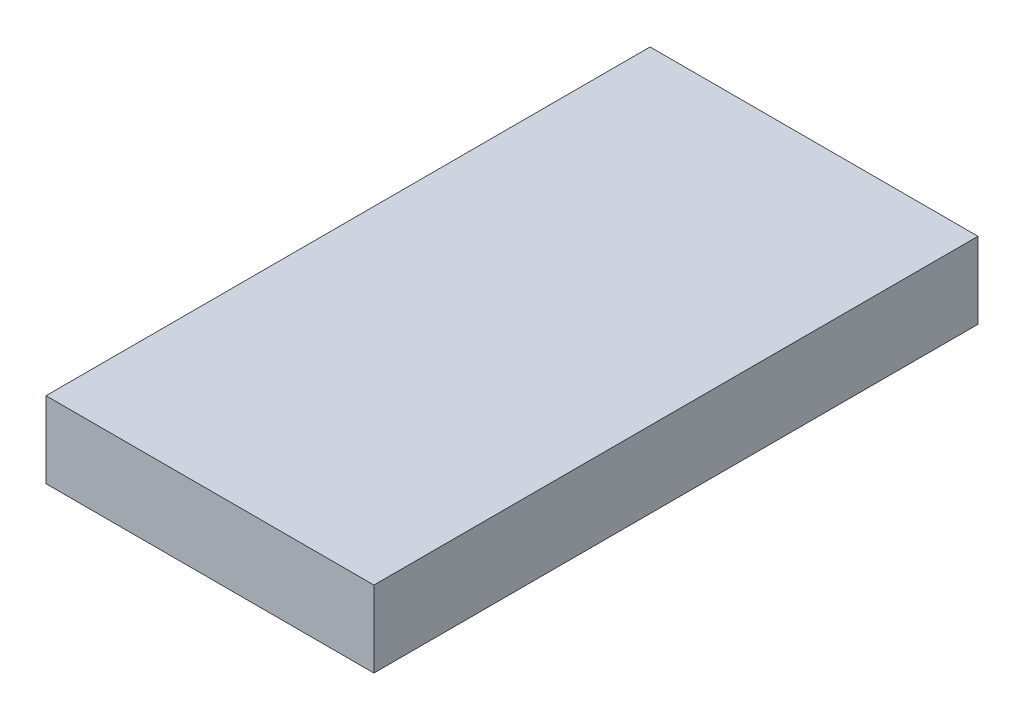
ISO-10303-21;
HEADER;
FILE_DESCRIPTION(('STEP AP214'),'2;1');
FILE_NAME('part.step','',(''),(''),'','','');
FILE_SCHEMA(('AUTOMOTIVE_DESIGN { 1 0 10303 214 1 1 1 1 }'));
ENDSEC;
DATA;
#1=APPLICATION_CONTEXT('core data for automotive mechanical design processes');
#2=APPLICATION_PROTOCOL_DEFINITION('international standard','automotive_design',2000,#1);
#3=PRODUCT_CONTEXT('',#1,'mechanical');
#4=PRODUCT('Part','Part','',(#3));
#5=PRODUCT_RELATED_PRODUCT_CATEGORY('part','',(#4));
#6=PRODUCT_DEFINITION_FORMATION('','',#4);
#7=PRODUCT_DEFINITION_CONTEXT('part definition',#1,'design');
#8=PRODUCT_DEFINITION('design','',#6,#7);
#9=PRODUCT_DEFINITION_SHAPE('','',#8);
#10=(LENGTH_UNIT() NAMED_UNIT(*) SI_UNIT(.MILLI.,.METRE.));
#11=(NAMED_UNIT(*) PLANE_ANGLE_UNIT() SI_UNIT($,.RADIAN.));
#12=(NAMED_UNIT(*) SI_UNIT($,.STERADIAN.) SOLID_ANGLE_UNIT());
#13=UNCERTAINTY_MEASURE_WITH_UNIT(LENGTH_MEASURE(1.E-05),#10,'distance_accuracy_value','');
#14=(GEOMETRIC_REPRESENTATION_CONTEXT(3) GLOBAL_UNCERTAINTY_ASSIGNED_CONTEXT((#13)) GLOBAL_UNIT_ASSIGNED_CONTEXT((#10,
#11,#12)) REPRESENTATION_CONTEXT('',''));
#15=CARTESIAN_POINT('',(0.,0.,0.));
#16=DIRECTION('',(0.,0.,1.));
#17=DIRECTION('',(1.,0.,0.));
#18=AXIS2_PLACEMENT_3D('',#15,#16,#17);
#19=CARTESIAN_POINT('',(28.5,13.25,-52.5));
#20=DIRECTION('',(-1.,0.,0.));
#21=DIRECTION('',(0.,0.,1.));
#22=AXIS2_PLACEMENT_3D('',#19,#20,#21);
#23=PLANE('',#22);
#24=DIRECTION('',(0.,0.,-1.));
#25=VECTOR('',#24,1.);
#26=CARTESIAN_POINT('',(28.5,0.,-52.5));
#27=LINE('',#26,#25);
#28=CARTESIAN_POINT('',(28.5,0.,52.5));
#29=VERTEX_POINT('',#28);
#30=CARTESIAN_POINT('',(28.5,0.,-52.5));
#31=VERTEX_POINT('',#30);
#32=EDGE_CURVE('E99',#29,#31,#27,.T.);
#33=ORIENTED_EDGE('',*,*,#32,.T.);
#34=DIRECTION('',(0.,-1.,0.));
#35=VECTOR('',#34,1.);
#36=CARTESIAN_POINT('',(28.5,13.25,-52.5));
#37=LINE('',#36,#35);
#38=CARTESIAN_POINT('',(28.5,13.25,-52.5));
#39=VERTEX_POINT('',#38);
#40=EDGE_CURVE('E11',#39,#31,#37,.T.);
#41=ORIENTED_EDGE('',*,*,#40,.F.);
#42=DIRECTION('',(0.,0.,-1.));
#43=VECTOR('',#42,1.);
#44=CARTESIAN_POINT('',(28.5,13.25,-52.5));
#45=LINE('',#44,#43);
#46=CARTESIAN_POINT('',(28.5,13.25,52.5));
#47=VERTEX_POINT('',#46);
#48=EDGE_CURVE('E87',#47,#39,#45,.T.);
#49=ORIENTED_EDGE('',*,*,#48,.F.);
#50=DIRECTION('',(0.,-1.,0.));
#51=VECTOR('',#50,1.);
#52=CARTESIAN_POINT('',(28.5,13.25,52.5));
#53=LINE('',#52,#51);
#54=EDGE_CURVE('E95',#47,#29,#53,.T.);
#55=ORIENTED_EDGE('',*,*,#54,.T.);
#56=EDGE_LOOP('',(#33,#41,#49,#55));
#57=FACE_BOUND('',#56,.T.);
#58=ADVANCED_FACE('F36',(#57),#23,.F.);
#59=CARTESIAN_POINT('',(-28.5,13.25,-52.5));
#60=DIRECTION('',(0.,0.,1.));
#61=DIRECTION('',(1.,0.,0.));
#62=AXIS2_PLACEMENT_3D('',#59,#60,#61);
#63=PLANE('',#62);
#64=DIRECTION('',(-1.,0.,0.));
#65=VECTOR('',#64,1.);
#66=CARTESIAN_POINT('',(-28.5,0.,-52.5));
#67=LINE('',#66,#65);
#68=CARTESIAN_POINT('',(-28.5,0.,-52.5));
#69=VERTEX_POINT('',#68);
#70=EDGE_CURVE('E91',#31,#69,#67,.T.);
#71=ORIENTED_EDGE('',*,*,#70,.T.);
#72=DIRECTION('',(0.,-1.,0.));
#73=VECTOR('',#72,1.);
#74=CARTESIAN_POINT('',(-28.5,13.25,-52.5));
#75=LINE('',#74,#73);
#76=CARTESIAN_POINT('',(-28.5,13.25,-52.5));
#77=VERTEX_POINT('',#76);
#78=EDGE_CURVE('E44',#77,#69,#75,.T.);
#79=ORIENTED_EDGE('',*,*,#78,.F.);
#80=DIRECTION('',(-1.,0.,0.));
#81=VECTOR('',#80,1.);
#82=CARTESIAN_POINT('',(-28.5,13.25,-52.5));
#83=LINE('',#82,#81);
#84=EDGE_CURVE('E82',#39,#77,#83,.T.);
#85=ORIENTED_EDGE('',*,*,#84,.F.);
#86=ORIENTED_EDGE('',*,*,#40,.T.);
#87=EDGE_LOOP('',(#71,#79,#85,#86));
#88=FACE_BOUND('',#87,.T.);
#89=ADVANCED_FACE('F90',(#88),#63,.F.);
#90=CARTESIAN_POINT('',(-28.5,13.25,-52.5));
#91=DIRECTION('',(1.,0.,0.));
#92=DIRECTION('',(0.,0.,-1.));
#93=AXIS2_PLACEMENT_3D('',#90,#91,#92);
#94=PLANE('',#93);
#95=DIRECTION('',(0.,0.,1.));
#96=VECTOR('',#95,1.);
#97=CARTESIAN_POINT('',(-28.5,0.,-52.5));
#98=LINE('',#97,#96);
#99=CARTESIAN_POINT('',(-28.5,0.,52.5));
#100=VERTEX_POINT('',#99);
#101=EDGE_CURVE('E69',#69,#100,#98,.T.);
#102=ORIENTED_EDGE('',*,*,#101,.T.);
#103=DIRECTION('',(0.,-1.,0.));
#104=VECTOR('',#103,1.);
#105=CARTESIAN_POINT('',(-28.5,13.25,52.5));
#106=LINE('',#105,#104);
#107=CARTESIAN_POINT('',(-28.5,13.25,52.5));
#108=VERTEX_POINT('',#107);
#109=EDGE_CURVE('E92',#108,#100,#106,.T.);
#110=ORIENTED_EDGE('',*,*,#109,.F.);
#111=DIRECTION('',(0.,0.,1.));
#112=VECTOR('',#111,1.);
#113=CARTESIAN_POINT('',(-28.5,13.25,-52.5));
#114=LINE('',#113,#112);
#115=EDGE_CURVE('E85',#77,#108,#114,.T.);
#116=ORIENTED_EDGE('',*,*,#115,.F.);
#117=ORIENTED_EDGE('',*,*,#78,.T.);
#118=EDGE_LOOP('',(#102,#110,#116,#117));
#119=FACE_BOUND('',#118,.T.);
#120=ADVANCED_FACE('F93',(#119),#94,.F.);
#121=CARTESIAN_POINT('',(-28.5,13.25,52.5));
#122=DIRECTION('',(0.,0.,-1.));
#123=DIRECTION('',(-1.,0.,0.));
#124=AXIS2_PLACEMENT_3D('',#121,#122,#123);
#125=PLANE('',#124);
#126=DIRECTION('',(1.,0.,0.));
#127=VECTOR('',#126,1.);
#128=CARTESIAN_POINT('',(-28.5,0.,52.5));
#129=LINE('',#128,#127);
#130=EDGE_CURVE('E75',#100,#29,#129,.T.);
#131=ORIENTED_EDGE('',*,*,#130,.T.);
#132=ORIENTED_EDGE('',*,*,#54,.F.);
#133=DIRECTION('',(1.,0.,0.));
#134=VECTOR('',#133,1.);
#135=CARTESIAN_POINT('',(-28.5,13.25,52.5));
#136=LINE('',#135,#134);
#137=EDGE_CURVE('E52',#108,#47,#136,.T.);
#138=ORIENTED_EDGE('',*,*,#137,.F.);
#139=ORIENTED_EDGE('',*,*,#109,.T.);
#140=EDGE_LOOP('',(#131,#132,#138,#139));
#141=FACE_BOUND('',#140,.T.);
#142=ADVANCED_FACE('F106',(#141),#125,.F.);
#143=CARTESIAN_POINT('',(0.,13.25,0.));
#144=DIRECTION('',(0.,1.,0.));
#145=DIRECTION('',(0.,0.,1.));
#146=AXIS2_PLACEMENT_3D('',#143,#144,#145);
#147=PLANE('',#146);
#148=ORIENTED_EDGE('',*,*,#48,.T.);
#149=ORIENTED_EDGE('',*,*,#84,.T.);
#150=ORIENTED_EDGE('',*,*,#115,.T.);
#151=ORIENTED_EDGE('',*,*,#137,.T.);
#152=EDGE_LOOP('',(#148,#149,#150,#151));
#153=FACE_BOUND('',#152,.T.);
#154=ADVANCED_FACE('F83',(#153),#147,.T.);
#155=CARTESIAN_POINT('',(0.,0.,0.));
#156=DIRECTION('',(0.,1.,0.));
#157=DIRECTION('',(0.,0.,1.));
#158=AXIS2_PLACEMENT_3D('',#155,#156,#157);
#159=PLANE('',#158);
#160=ORIENTED_EDGE('',*,*,#32,.F.);
#161=ORIENTED_EDGE('',*,*,#130,.F.);
#162=ORIENTED_EDGE('',*,*,#101,.F.);
#163=ORIENTED_EDGE('',*,*,#70,.F.);
#164=EDGE_LOOP('',(#160,#161,#162,#163));
#165=FACE_BOUND('',#164,.T.);
#166=ADVANCED_FACE('F109',(#165),#159,.F.);
#167=CLOSED_SHELL('',(#58,#89,#120,#142,#154,#166));
#168=MANIFOLD_SOLID_BREP('B2',#167);
#169=ADVANCED_BREP_SHAPE_REPRESENTATION('',(#18,#168),#14);
#170=SHAPE_DEFINITION_REPRESENTATION(#9,#169);
ENDSEC;
END-ISO-10303-21;
